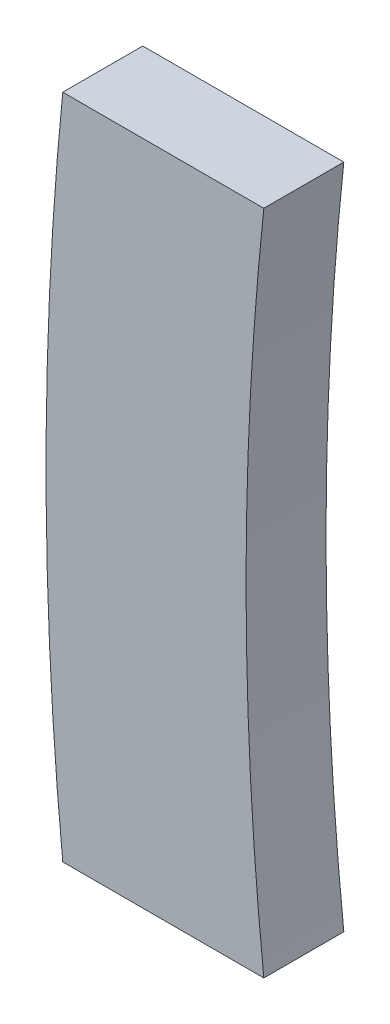
ISO-10303-21;
HEADER;
FILE_DESCRIPTION(('STEP AP214'),'2;1');
FILE_NAME('part.step','',(''),(''),'','','');
FILE_SCHEMA(('AUTOMOTIVE_DESIGN { 1 0 10303 214 1 1 1 1 }'));
ENDSEC;
DATA;
#1=APPLICATION_CONTEXT('core data for automotive mechanical design processes');
#2=APPLICATION_PROTOCOL_DEFINITION('international standard','automotive_design',2000,#1);
#3=PRODUCT_CONTEXT('',#1,'mechanical');
#4=PRODUCT('Part','Part','',(#3));
#5=PRODUCT_RELATED_PRODUCT_CATEGORY('part','',(#4));
#6=PRODUCT_DEFINITION_FORMATION('','',#4);
#7=PRODUCT_DEFINITION_CONTEXT('part definition',#1,'design');
#8=PRODUCT_DEFINITION('design','',#6,#7);
#9=PRODUCT_DEFINITION_SHAPE('','',#8);
#10=(LENGTH_UNIT() NAMED_UNIT(*) SI_UNIT(.MILLI.,.METRE.));
#11=(NAMED_UNIT(*) PLANE_ANGLE_UNIT() SI_UNIT($,.RADIAN.));
#12=(NAMED_UNIT(*) SI_UNIT($,.STERADIAN.) SOLID_ANGLE_UNIT());
#13=UNCERTAINTY_MEASURE_WITH_UNIT(LENGTH_MEASURE(1.E-05),#10,'distance_accuracy_value','');
#14=(GEOMETRIC_REPRESENTATION_CONTEXT(3) GLOBAL_UNCERTAINTY_ASSIGNED_CONTEXT((#13)) GLOBAL_UNIT_ASSIGNED_CONTEXT((#10,
#11,#12)) REPRESENTATION_CONTEXT('',''));
#15=CARTESIAN_POINT('',(0.,0.,0.));
#16=DIRECTION('',(0.,0.,1.));
#17=DIRECTION('',(1.,0.,0.));
#18=AXIS2_PLACEMENT_3D('',#15,#16,#17);
#19=CARTESIAN_POINT('',(-269.99,0.,57.));
#20=DIRECTION('',(0.,0.,1.));
#21=DIRECTION('',(1.,0.,0.));
#22=AXIS2_PLACEMENT_3D('',#19,#20,#21);
#23=PLANE('',#22);
#24=DIRECTION('',(-1.,0.,0.));
#25=VECTOR('',#24,1.);
#26=CARTESIAN_POINT('',(-269.99,-4.99999999999995,57.));
#27=LINE('',#26,#25);
#28=CARTESIAN_POINT('',(-346.733285782192,-4.99999999999994,57.));
#29=VERTEX_POINT('',#28);
#30=CARTESIAN_POINT('',(-349.749371855331,-4.99999999999994,57.));
#31=VERTEX_POINT('',#30);
#32=EDGE_CURVE('E52',#29,#31,#27,.T.);
#33=ORIENTED_EDGE('',*,*,#32,.F.);
#34=CARTESIAN_POINT('',(-300.,0.,57.));
#35=DIRECTION('',(0.,0.,1.));
#36=DIRECTION('',(1.,0.,0.));
#37=AXIS2_PLACEMENT_3D('',#34,#35,#36);
#38=CIRCLE('',#37,47.);
#39=CARTESIAN_POINT('',(-346.733285782192,5.00000000000017,57.));
#40=VERTEX_POINT('',#39);
#41=EDGE_CURVE('E89',#29,#40,#38,.F.);
#42=ORIENTED_EDGE('',*,*,#41,.T.);
#43=DIRECTION('',(-1.,0.,0.));
#44=VECTOR('',#43,1.);
#45=CARTESIAN_POINT('',(-269.99,5.00000000000004,57.));
#46=LINE('',#45,#44);
#47=CARTESIAN_POINT('',(-349.749371855331,5.00000000000005,57.));
#48=VERTEX_POINT('',#47);
#49=EDGE_CURVE('E11',#40,#48,#46,.T.);
#50=ORIENTED_EDGE('',*,*,#49,.T.);
#51=CARTESIAN_POINT('',(-300.,0.,57.));
#52=DIRECTION('',(0.,0.,1.));
#53=DIRECTION('',(1.,0.,0.));
#54=AXIS2_PLACEMENT_3D('',#51,#52,#53);
#55=CIRCLE('',#54,50.);
#56=EDGE_CURVE('E39',#48,#31,#55,.T.);
#57=ORIENTED_EDGE('',*,*,#56,.T.);
#58=EDGE_LOOP('',(#33,#42,#50,#57));
#59=FACE_BOUND('',#58,.T.);
#60=ADVANCED_FACE('F35',(#59),#23,.T.);
#61=CARTESIAN_POINT('',(-269.99,-4.99999999999996,55.8));
#62=DIRECTION('',(0.,-1.,0.));
#63=DIRECTION('',(0.,0.,-1.));
#64=AXIS2_PLACEMENT_3D('',#61,#62,#63);
#65=PLANE('',#64);
#66=DIRECTION('',(-1.,0.,0.));
#67=VECTOR('',#66,1.);
#68=CARTESIAN_POINT('',(-269.99,-4.99999999999996,55.8));
#69=LINE('',#68,#67);
#70=CARTESIAN_POINT('',(-346.733285782192,-4.99999999999995,55.8));
#71=VERTEX_POINT('',#70);
#72=CARTESIAN_POINT('',(-349.749371855331,-4.99999999999994,55.8));
#73=VERTEX_POINT('',#72);
#74=EDGE_CURVE('E60',#71,#73,#69,.T.);
#75=ORIENTED_EDGE('',*,*,#74,.F.);
#76=DIRECTION('',(0.,0.,1.));
#77=VECTOR('',#76,1.);
#78=CARTESIAN_POINT('',(-346.733285782192,-5.00000000000006,3.00000000000001));
#79=LINE('',#78,#77);
#80=EDGE_CURVE('E77',#71,#29,#79,.T.);
#81=ORIENTED_EDGE('',*,*,#80,.T.);
#82=ORIENTED_EDGE('',*,*,#32,.T.);
#83=DIRECTION('',(0.,0.,-1.));
#84=VECTOR('',#83,1.);
#85=CARTESIAN_POINT('',(-349.749371855331,-4.99999999999994,60.));
#86=LINE('',#85,#84);
#87=EDGE_CURVE('E79',#31,#73,#86,.T.);
#88=ORIENTED_EDGE('',*,*,#87,.T.);
#89=EDGE_LOOP('',(#75,#81,#82,#88));
#90=FACE_BOUND('',#89,.T.);
#91=ADVANCED_FACE('F75',(#90),#65,.T.);
#92=CARTESIAN_POINT('',(-269.99,5.00000000000004,55.8));
#93=DIRECTION('',(0.,1.,0.));
#94=DIRECTION('',(0.,0.,1.));
#95=AXIS2_PLACEMENT_3D('',#92,#93,#94);
#96=PLANE('',#95);
#97=ORIENTED_EDGE('',*,*,#49,.F.);
#98=DIRECTION('',(0.,0.,1.));
#99=VECTOR('',#98,1.);
#100=CARTESIAN_POINT('',(-346.733285782192,5.00000000000017,3.00000000000001));
#101=LINE('',#100,#99);
#102=CARTESIAN_POINT('',(-346.733285782192,5.00000000000017,55.8));
#103=VERTEX_POINT('',#102);
#104=EDGE_CURVE('E98',#40,#103,#101,.F.);
#105=ORIENTED_EDGE('',*,*,#104,.T.);
#106=DIRECTION('',(-1.,0.,0.));
#107=VECTOR('',#106,1.);
#108=CARTESIAN_POINT('',(-269.99,5.00000000000004,55.8));
#109=LINE('',#108,#107);
#110=CARTESIAN_POINT('',(-349.749371855331,5.00000000000006,55.8));
#111=VERTEX_POINT('',#110);
#112=EDGE_CURVE('E44',#103,#111,#109,.T.);
#113=ORIENTED_EDGE('',*,*,#112,.T.);
#114=DIRECTION('',(0.,0.,-1.));
#115=VECTOR('',#114,1.);
#116=CARTESIAN_POINT('',(-349.749371855331,5.00000000000005,60.));
#117=LINE('',#116,#115);
#118=EDGE_CURVE('E81',#48,#111,#117,.T.);
#119=ORIENTED_EDGE('',*,*,#118,.F.);
#120=EDGE_LOOP('',(#97,#105,#113,#119));
#121=FACE_BOUND('',#120,.T.);
#122=ADVANCED_FACE('F107',(#121),#96,.T.);
#123=CARTESIAN_POINT('',(-269.99,0.,55.8));
#124=DIRECTION('',(0.,0.,-1.));
#125=DIRECTION('',(0.,1.,0.));
#126=AXIS2_PLACEMENT_3D('',#123,#124,#125);
#127=PLANE('',#126);
#128=ORIENTED_EDGE('',*,*,#112,.F.);
#129=CARTESIAN_POINT('',(-300.,0.,55.8));
#130=DIRECTION('',(0.,0.,-1.));
#131=DIRECTION('',(0.,1.,0.));
#132=AXIS2_PLACEMENT_3D('',#129,#130,#131);
#133=CIRCLE('',#132,47.);
#134=EDGE_CURVE('E84',#103,#71,#133,.F.);
#135=ORIENTED_EDGE('',*,*,#134,.T.);
#136=ORIENTED_EDGE('',*,*,#74,.T.);
#137=CARTESIAN_POINT('',(-300.,0.,55.8));
#138=DIRECTION('',(0.,0.,-1.));
#139=DIRECTION('',(0.,1.,0.));
#140=AXIS2_PLACEMENT_3D('',#137,#138,#139);
#141=CIRCLE('',#140,50.);
#142=EDGE_CURVE('E100',#73,#111,#141,.T.);
#143=ORIENTED_EDGE('',*,*,#142,.T.);
#144=EDGE_LOOP('',(#128,#135,#136,#143));
#145=FACE_BOUND('',#144,.T.);
#146=ADVANCED_FACE('F85',(#145),#127,.T.);
#147=CARTESIAN_POINT('',(-300.,0.,60.));
#148=DIRECTION('',(0.,0.,-1.));
#149=DIRECTION('',(-1.,0.,0.));
#150=AXIS2_PLACEMENT_3D('',#147,#148,#149);
#151=CYLINDRICAL_SURFACE('',#150,50.);
#152=ORIENTED_EDGE('',*,*,#118,.T.);
#153=ORIENTED_EDGE('',*,*,#142,.F.);
#154=ORIENTED_EDGE('',*,*,#87,.F.);
#155=ORIENTED_EDGE('',*,*,#56,.F.);
#156=EDGE_LOOP('',(#152,#153,#154,#155));
#157=FACE_BOUND('',#156,.T.);
#158=ADVANCED_FACE('F105',(#157),#151,.T.);
#159=CARTESIAN_POINT('',(-300.,0.,3.));
#160=DIRECTION('',(0.,0.,1.));
#161=DIRECTION('',(1.,0.,0.));
#162=AXIS2_PLACEMENT_3D('',#159,#160,#161);
#163=CYLINDRICAL_SURFACE('',#162,47.);
#164=ORIENTED_EDGE('',*,*,#80,.F.);
#165=ORIENTED_EDGE('',*,*,#134,.F.);
#166=ORIENTED_EDGE('',*,*,#104,.F.);
#167=ORIENTED_EDGE('',*,*,#41,.F.);
#168=EDGE_LOOP('',(#164,#165,#166,#167));
#169=FACE_BOUND('',#168,.T.);
#170=ADVANCED_FACE('F37',(#169),#163,.F.);
#171=CLOSED_SHELL('',(#60,#91,#122,#146,#158,#170));
#172=MANIFOLD_SOLID_BREP('B2',#171);
#173=ADVANCED_BREP_SHAPE_REPRESENTATION('',(#18,#172),#14);
#174=SHAPE_DEFINITION_REPRESENTATION(#9,#173);
ENDSEC;
END-ISO-10303-21;
